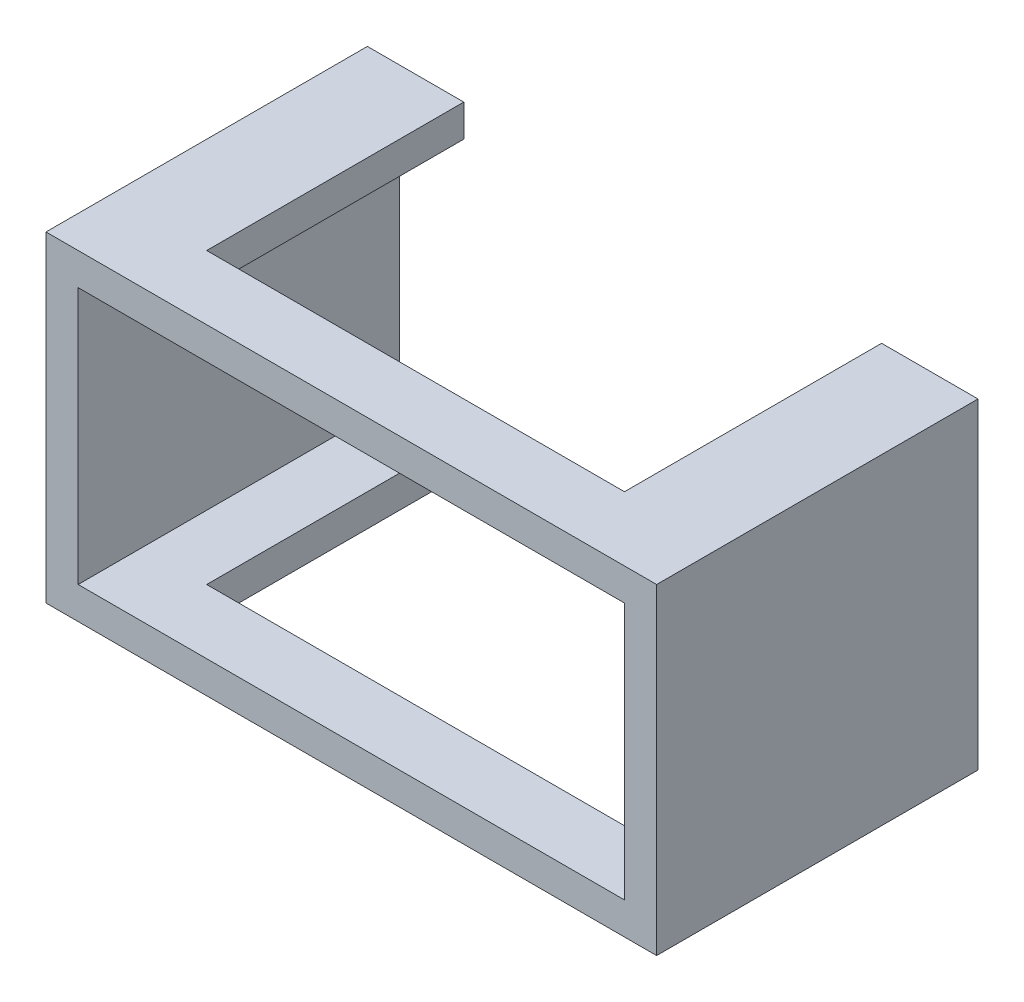
ISO-10303-21;
HEADER;
FILE_DESCRIPTION(('STEP AP214'),'2;1');
FILE_NAME('part.step','',(''),(''),'','','');
FILE_SCHEMA(('AUTOMOTIVE_DESIGN { 1 0 10303 214 1 1 1 1 }'));
ENDSEC;
DATA;
#1=APPLICATION_CONTEXT('core data for automotive mechanical design processes');
#2=APPLICATION_PROTOCOL_DEFINITION('international standard','automotive_design',2000,#1);
#3=PRODUCT_CONTEXT('',#1,'mechanical');
#4=PRODUCT('Part','Part','',(#3));
#5=PRODUCT_RELATED_PRODUCT_CATEGORY('part','',(#4));
#6=PRODUCT_DEFINITION_FORMATION('','',#4);
#7=PRODUCT_DEFINITION_CONTEXT('part definition',#1,'design');
#8=PRODUCT_DEFINITION('design','',#6,#7);
#9=PRODUCT_DEFINITION_SHAPE('','',#8);
#10=(LENGTH_UNIT() NAMED_UNIT(*) SI_UNIT(.MILLI.,.METRE.));
#11=(NAMED_UNIT(*) PLANE_ANGLE_UNIT() SI_UNIT($,.RADIAN.));
#12=(NAMED_UNIT(*) SI_UNIT($,.STERADIAN.) SOLID_ANGLE_UNIT());
#13=UNCERTAINTY_MEASURE_WITH_UNIT(LENGTH_MEASURE(1.E-05),#10,'distance_accuracy_value','');
#14=(GEOMETRIC_REPRESENTATION_CONTEXT(3) GLOBAL_UNCERTAINTY_ASSIGNED_CONTEXT((#13)) GLOBAL_UNIT_ASSIGNED_CONTEXT((#10,
#11,#12)) REPRESENTATION_CONTEXT('',''));
#15=CARTESIAN_POINT('',(0.,0.,0.));
#16=DIRECTION('',(0.,0.,1.));
#17=DIRECTION('',(1.,0.,0.));
#18=AXIS2_PLACEMENT_3D('',#15,#16,#17);
#19=CARTESIAN_POINT('',(-9.63013698630135,-2.77739726027397,10.));
#20=DIRECTION('',(0.,1.,0.));
#21=DIRECTION('',(0.,0.,1.));
#22=AXIS2_PLACEMENT_3D('',#19,#20,#21);
#23=PLANE('',#22);
#24=DIRECTION('',(0.,0.,-1.));
#25=VECTOR('',#24,1.);
#26=CARTESIAN_POINT('',(-6.63013698630135,-2.77739726027397,10.));
#27=LINE('',#26,#25);
#28=CARTESIAN_POINT('',(-6.63013698630135,-2.77739726027397,8.));
#29=VERTEX_POINT('',#28);
#30=CARTESIAN_POINT('',(-6.63013698630135,-2.77739726027397,0.));
#31=VERTEX_POINT('',#30);
#32=EDGE_CURVE('E166',#29,#31,#27,.T.);
#33=ORIENTED_EDGE('',*,*,#32,.F.);
#34=DIRECTION('',(1.,0.,0.));
#35=VECTOR('',#34,1.);
#36=CARTESIAN_POINT('',(-9.63013698630135,-2.77739726027397,8.));
#37=LINE('',#36,#35);
#38=CARTESIAN_POINT('',(6.36986301369865,-2.77739726027397,8.));
#39=VERTEX_POINT('',#38);
#40=EDGE_CURVE('E236',#29,#39,#37,.T.);
#41=ORIENTED_EDGE('',*,*,#40,.T.);
#42=DIRECTION('',(0.,0.,-1.));
#43=VECTOR('',#42,1.);
#44=CARTESIAN_POINT('',(6.36986301369865,-2.77739726027397,10.));
#45=LINE('',#44,#43);
#46=CARTESIAN_POINT('',(6.36986301369865,-2.77739726027397,0.));
#47=VERTEX_POINT('',#46);
#48=EDGE_CURVE('E244',#39,#47,#45,.T.);
#49=ORIENTED_EDGE('',*,*,#48,.T.);
#50=DIRECTION('',(1.,0.,0.));
#51=VECTOR('',#50,1.);
#52=CARTESIAN_POINT('',(-9.63013698630135,-2.77739726027397,0.));
#53=LINE('',#52,#51);
#54=CARTESIAN_POINT('',(9.36986301369865,-2.77739726027397,0.));
#55=VERTEX_POINT('',#54);
#56=EDGE_CURVE('E227',#47,#55,#53,.T.);
#57=ORIENTED_EDGE('',*,*,#56,.T.);
#58=DIRECTION('',(0.,0.,-1.));
#59=VECTOR('',#58,1.);
#60=CARTESIAN_POINT('',(9.36986301369865,-2.77739726027397,10.));
#61=LINE('',#60,#59);
#62=CARTESIAN_POINT('',(9.36986301369865,-2.77739726027397,10.));
#63=VERTEX_POINT('',#62);
#64=EDGE_CURVE('E188',#63,#55,#61,.T.);
#65=ORIENTED_EDGE('',*,*,#64,.F.);
#66=DIRECTION('',(1.,0.,0.));
#67=VECTOR('',#66,1.);
#68=CARTESIAN_POINT('',(-9.63013698630135,-2.77739726027397,10.));
#69=LINE('',#68,#67);
#70=CARTESIAN_POINT('',(-9.63013698630135,-2.77739726027397,10.));
#71=VERTEX_POINT('',#70);
#72=EDGE_CURVE('E270',#71,#63,#69,.T.);
#73=ORIENTED_EDGE('',*,*,#72,.F.);
#74=DIRECTION('',(0.,0.,-1.));
#75=VECTOR('',#74,1.);
#76=CARTESIAN_POINT('',(-9.63013698630135,-2.77739726027397,10.));
#77=LINE('',#76,#75);
#78=CARTESIAN_POINT('',(-9.63013698630135,-2.77739726027397,0.));
#79=VERTEX_POINT('',#78);
#80=EDGE_CURVE('E191',#71,#79,#77,.T.);
#81=ORIENTED_EDGE('',*,*,#80,.T.);
#82=EDGE_CURVE('E178',#79,#31,#53,.T.);
#83=ORIENTED_EDGE('',*,*,#82,.T.);
#84=EDGE_LOOP('',(#33,#41,#49,#57,#65,#73,#81,#83));
#85=FACE_BOUND('',#84,.T.);
#86=ADVANCED_FACE('F33',(#85),#23,.F.);
#87=CARTESIAN_POINT('',(-9.63013698630135,7.22260273972603,10.));
#88=DIRECTION('',(0.,-1.,0.));
#89=DIRECTION('',(0.,0.,-1.));
#90=AXIS2_PLACEMENT_3D('',#87,#88,#89);
#91=PLANE('',#90);
#92=DIRECTION('',(0.,0.,1.));
#93=VECTOR('',#92,1.);
#94=CARTESIAN_POINT('',(-6.63013698630135,7.22260273972603,10.));
#95=LINE('',#94,#93);
#96=CARTESIAN_POINT('',(-6.63013698630135,7.22260273972603,0.));
#97=VERTEX_POINT('',#96);
#98=CARTESIAN_POINT('',(-6.63013698630135,7.22260273972603,8.));
#99=VERTEX_POINT('',#98);
#100=EDGE_CURVE('E148',#97,#99,#95,.T.);
#101=ORIENTED_EDGE('',*,*,#100,.F.);
#102=DIRECTION('',(-1.,0.,0.));
#103=VECTOR('',#102,1.);
#104=CARTESIAN_POINT('',(-9.63013698630135,7.22260273972603,0.));
#105=LINE('',#104,#103);
#106=CARTESIAN_POINT('',(-9.63013698630135,7.22260273972603,0.));
#107=VERTEX_POINT('',#106);
#108=EDGE_CURVE('E162',#97,#107,#105,.T.);
#109=ORIENTED_EDGE('',*,*,#108,.T.);
#110=DIRECTION('',(0.,0.,-1.));
#111=VECTOR('',#110,1.);
#112=CARTESIAN_POINT('',(-9.63013698630135,7.22260273972603,10.));
#113=LINE('',#112,#111);
#114=CARTESIAN_POINT('',(-9.63013698630135,7.22260273972603,10.));
#115=VERTEX_POINT('',#114);
#116=EDGE_CURVE('E182',#115,#107,#113,.T.);
#117=ORIENTED_EDGE('',*,*,#116,.F.);
#118=DIRECTION('',(-1.,0.,0.));
#119=VECTOR('',#118,1.);
#120=CARTESIAN_POINT('',(-9.63013698630135,7.22260273972603,10.));
#121=LINE('',#120,#119);
#122=CARTESIAN_POINT('',(9.36986301369865,7.22260273972603,10.));
#123=VERTEX_POINT('',#122);
#124=EDGE_CURVE('E185',#123,#115,#121,.T.);
#125=ORIENTED_EDGE('',*,*,#124,.F.);
#126=DIRECTION('',(0.,0.,-1.));
#127=VECTOR('',#126,1.);
#128=CARTESIAN_POINT('',(9.36986301369865,7.22260273972603,10.));
#129=LINE('',#128,#127);
#130=CARTESIAN_POINT('',(9.36986301369865,7.22260273972603,0.));
#131=VERTEX_POINT('',#130);
#132=EDGE_CURVE('E184',#123,#131,#129,.T.);
#133=ORIENTED_EDGE('',*,*,#132,.T.);
#134=CARTESIAN_POINT('',(6.36986301369865,7.22260273972603,0.));
#135=VERTEX_POINT('',#134);
#136=EDGE_CURVE('E173',#131,#135,#105,.T.);
#137=ORIENTED_EDGE('',*,*,#136,.T.);
#138=DIRECTION('',(0.,0.,1.));
#139=VECTOR('',#138,1.);
#140=CARTESIAN_POINT('',(6.36986301369865,7.22260273972603,10.));
#141=LINE('',#140,#139);
#142=CARTESIAN_POINT('',(6.36986301369865,7.22260273972603,8.));
#143=VERTEX_POINT('',#142);
#144=EDGE_CURVE('E242',#135,#143,#141,.T.);
#145=ORIENTED_EDGE('',*,*,#144,.T.);
#146=DIRECTION('',(-1.,0.,0.));
#147=VECTOR('',#146,1.);
#148=CARTESIAN_POINT('',(-9.63013698630135,7.22260273972603,8.));
#149=LINE('',#148,#147);
#150=EDGE_CURVE('E165',#143,#99,#149,.T.);
#151=ORIENTED_EDGE('',*,*,#150,.T.);
#152=EDGE_LOOP('',(#101,#109,#117,#125,#133,#137,#145,#151));
#153=FACE_BOUND('',#152,.T.);
#154=ADVANCED_FACE('F160',(#153),#91,.F.);
#155=CARTESIAN_POINT('',(0.,0.,0.));
#156=DIRECTION('',(0.,0.,1.));
#157=DIRECTION('',(1.,0.,0.));
#158=AXIS2_PLACEMENT_3D('',#155,#156,#157);
#159=PLANE('',#158);
#160=DIRECTION('',(0.,-1.,0.));
#161=VECTOR('',#160,1.);
#162=CARTESIAN_POINT('',(-6.63013698630135,7.60514930969981,0.));
#163=LINE('',#162,#161);
#164=CARTESIAN_POINT('',(-6.63013698630135,-1.77739726027397,0.));
#165=VERTEX_POINT('',#164);
#166=EDGE_CURVE('E156',#165,#31,#163,.T.);
#167=ORIENTED_EDGE('',*,*,#166,.T.);
#168=ORIENTED_EDGE('',*,*,#82,.F.);
#169=DIRECTION('',(0.,-1.,0.));
#170=VECTOR('',#169,1.);
#171=CARTESIAN_POINT('',(-9.63013698630135,7.22260273972603,0.));
#172=LINE('',#171,#170);
#173=EDGE_CURVE('E172',#107,#79,#172,.T.);
#174=ORIENTED_EDGE('',*,*,#173,.F.);
#175=ORIENTED_EDGE('',*,*,#108,.F.);
#176=CARTESIAN_POINT('',(-6.63013698630135,6.22260273972603,0.));
#177=VERTEX_POINT('',#176);
#178=EDGE_CURVE('E144',#97,#177,#163,.T.);
#179=ORIENTED_EDGE('',*,*,#178,.T.);
#180=DIRECTION('',(-1.,0.,0.));
#181=VECTOR('',#180,1.);
#182=CARTESIAN_POINT('',(0.,6.22260273972603,0.));
#183=LINE('',#182,#181);
#184=CARTESIAN_POINT('',(-8.63013698630136,6.22260273972603,0.));
#185=VERTEX_POINT('',#184);
#186=EDGE_CURVE('E201',#177,#185,#183,.T.);
#187=ORIENTED_EDGE('',*,*,#186,.T.);
#188=DIRECTION('',(0.,-1.,0.));
#189=VECTOR('',#188,1.);
#190=CARTESIAN_POINT('',(-8.63013698630135,0.,0.));
#191=LINE('',#190,#189);
#192=CARTESIAN_POINT('',(-8.63013698630135,-1.77739726027397,0.));
#193=VERTEX_POINT('',#192);
#194=EDGE_CURVE('E205',#185,#193,#191,.T.);
#195=ORIENTED_EDGE('',*,*,#194,.T.);
#196=DIRECTION('',(1.,0.,0.));
#197=VECTOR('',#196,1.);
#198=CARTESIAN_POINT('',(0.,-1.77739726027397,0.));
#199=LINE('',#198,#197);
#200=EDGE_CURVE('E195',#193,#165,#199,.T.);
#201=ORIENTED_EDGE('',*,*,#200,.T.);
#202=EDGE_LOOP('',(#167,#168,#174,#175,#179,#187,#195,#201));
#203=FACE_BOUND('',#202,.T.);
#204=ADVANCED_FACE('F170',(#203),#159,.F.);
#205=CARTESIAN_POINT('',(-8.63013698630136,6.22260273972603,-2.));
#206=DIRECTION('',(0.,1.,0.));
#207=DIRECTION('',(0.,0.,1.));
#208=AXIS2_PLACEMENT_3D('',#205,#206,#207);
#209=PLANE('',#208);
#210=DIRECTION('',(0.,0.,-1.));
#211=VECTOR('',#210,1.);
#212=CARTESIAN_POINT('',(-6.63013698630135,6.22260273972603,-2.));
#213=LINE('',#212,#211);
#214=CARTESIAN_POINT('',(-6.63013698630135,6.22260273972603,8.));
#215=VERTEX_POINT('',#214);
#216=EDGE_CURVE('E151',#215,#177,#213,.T.);
#217=ORIENTED_EDGE('',*,*,#216,.F.);
#218=DIRECTION('',(1.,0.,0.));
#219=VECTOR('',#218,1.);
#220=CARTESIAN_POINT('',(-8.63013698630136,6.22260273972603,8.));
#221=LINE('',#220,#219);
#222=CARTESIAN_POINT('',(6.36986301369865,6.22260273972603,8.));
#223=VERTEX_POINT('',#222);
#224=EDGE_CURVE('E232',#215,#223,#221,.T.);
#225=ORIENTED_EDGE('',*,*,#224,.T.);
#226=DIRECTION('',(0.,0.,-1.));
#227=VECTOR('',#226,1.);
#228=CARTESIAN_POINT('',(6.36986301369865,6.22260273972603,-2.));
#229=LINE('',#228,#227);
#230=CARTESIAN_POINT('',(6.36986301369865,6.22260273972603,0.));
#231=VERTEX_POINT('',#230);
#232=EDGE_CURVE('E239',#223,#231,#229,.T.);
#233=ORIENTED_EDGE('',*,*,#232,.T.);
#234=CARTESIAN_POINT('',(8.36986301369865,6.22260273972603,0.));
#235=VERTEX_POINT('',#234);
#236=EDGE_CURVE('E202',#235,#231,#183,.T.);
#237=ORIENTED_EDGE('',*,*,#236,.F.);
#238=DIRECTION('',(0.,0.,1.));
#239=VECTOR('',#238,1.);
#240=CARTESIAN_POINT('',(8.36986301369865,6.22260273972603,-2.));
#241=LINE('',#240,#239);
#242=CARTESIAN_POINT('',(8.36986301369865,6.22260273972603,10.));
#243=VERTEX_POINT('',#242);
#244=EDGE_CURVE('E262',#235,#243,#241,.T.);
#245=ORIENTED_EDGE('',*,*,#244,.T.);
#246=DIRECTION('',(-1.,0.,0.));
#247=VECTOR('',#246,1.);
#248=CARTESIAN_POINT('',(-8.63013698630136,6.22260273972603,10.));
#249=LINE('',#248,#247);
#250=CARTESIAN_POINT('',(-8.63013698630136,6.22260273972603,10.));
#251=VERTEX_POINT('',#250);
#252=EDGE_CURVE('E256',#243,#251,#249,.T.);
#253=ORIENTED_EDGE('',*,*,#252,.T.);
#254=DIRECTION('',(0.,0.,1.));
#255=VECTOR('',#254,1.);
#256=CARTESIAN_POINT('',(-8.63013698630136,6.22260273972603,-2.));
#257=LINE('',#256,#255);
#258=EDGE_CURVE('E260',#185,#251,#257,.T.);
#259=ORIENTED_EDGE('',*,*,#258,.F.);
#260=ORIENTED_EDGE('',*,*,#186,.F.);
#261=EDGE_LOOP('',(#217,#225,#233,#237,#245,#253,#259,#260));
#262=FACE_BOUND('',#261,.T.);
#263=ADVANCED_FACE('F297',(#262),#209,.F.);
#264=CARTESIAN_POINT('',(-8.63013698630135,-1.77739726027397,-2.));
#265=DIRECTION('',(0.,-1.,0.));
#266=DIRECTION('',(1.,0.,0.));
#267=AXIS2_PLACEMENT_3D('',#264,#265,#266);
#268=PLANE('',#267);
#269=DIRECTION('',(0.,0.,1.));
#270=VECTOR('',#269,1.);
#271=CARTESIAN_POINT('',(-6.63013698630135,-1.77739726027397,-2.));
#272=LINE('',#271,#270);
#273=CARTESIAN_POINT('',(-6.63013698630135,-1.77739726027397,8.));
#274=VERTEX_POINT('',#273);
#275=EDGE_CURVE('E11',#165,#274,#272,.T.);
#276=ORIENTED_EDGE('',*,*,#275,.F.);
#277=ORIENTED_EDGE('',*,*,#200,.F.);
#278=DIRECTION('',(0.,0.,1.));
#279=VECTOR('',#278,1.);
#280=CARTESIAN_POINT('',(-8.63013698630135,-1.77739726027397,-2.));
#281=LINE('',#280,#279);
#282=CARTESIAN_POINT('',(-8.63013698630135,-1.77739726027397,10.));
#283=VERTEX_POINT('',#282);
#284=EDGE_CURVE('E259',#193,#283,#281,.T.);
#285=ORIENTED_EDGE('',*,*,#284,.T.);
#286=DIRECTION('',(1.,0.,0.));
#287=VECTOR('',#286,1.);
#288=CARTESIAN_POINT('',(-8.63013698630135,-1.77739726027397,10.));
#289=LINE('',#288,#287);
#290=CARTESIAN_POINT('',(8.36986301369865,-1.77739726027397,10.));
#291=VERTEX_POINT('',#290);
#292=EDGE_CURVE('E250',#283,#291,#289,.T.);
#293=ORIENTED_EDGE('',*,*,#292,.T.);
#294=DIRECTION('',(0.,0.,1.));
#295=VECTOR('',#294,1.);
#296=CARTESIAN_POINT('',(8.36986301369865,-1.77739726027397,-2.));
#297=LINE('',#296,#295);
#298=CARTESIAN_POINT('',(8.36986301369865,-1.77739726027397,0.));
#299=VERTEX_POINT('',#298);
#300=EDGE_CURVE('E264',#299,#291,#297,.T.);
#301=ORIENTED_EDGE('',*,*,#300,.F.);
#302=CARTESIAN_POINT('',(6.36986301369865,-1.77739726027397,0.));
#303=VERTEX_POINT('',#302);
#304=EDGE_CURVE('E194',#303,#299,#199,.T.);
#305=ORIENTED_EDGE('',*,*,#304,.F.);
#306=DIRECTION('',(0.,0.,1.));
#307=VECTOR('',#306,1.);
#308=CARTESIAN_POINT('',(6.36986301369865,-1.77739726027397,-2.));
#309=LINE('',#308,#307);
#310=CARTESIAN_POINT('',(6.36986301369865,-1.77739726027397,8.));
#311=VERTEX_POINT('',#310);
#312=EDGE_CURVE('E41',#303,#311,#309,.T.);
#313=ORIENTED_EDGE('',*,*,#312,.T.);
#314=DIRECTION('',(-1.,0.,0.));
#315=VECTOR('',#314,1.);
#316=CARTESIAN_POINT('',(-8.63013698630135,-1.77739726027397,8.));
#317=LINE('',#316,#315);
#318=EDGE_CURVE('E208',#311,#274,#317,.T.);
#319=ORIENTED_EDGE('',*,*,#318,.T.);
#320=EDGE_LOOP('',(#276,#277,#285,#293,#301,#305,#313,#319));
#321=FACE_BOUND('',#320,.T.);
#322=ADVANCED_FACE('F214',(#321),#268,.F.);
#323=CARTESIAN_POINT('',(-9.63013698630135,7.22260273972603,10.));
#324=DIRECTION('',(1.,0.,0.));
#325=DIRECTION('',(0.,1.,0.));
#326=AXIS2_PLACEMENT_3D('',#323,#324,#325);
#327=PLANE('',#326);
#328=ORIENTED_EDGE('',*,*,#173,.T.);
#329=ORIENTED_EDGE('',*,*,#80,.F.);
#330=DIRECTION('',(0.,-1.,0.));
#331=VECTOR('',#330,1.);
#332=CARTESIAN_POINT('',(-9.63013698630135,7.22260273972603,10.));
#333=LINE('',#332,#331);
#334=EDGE_CURVE('E177',#115,#71,#333,.T.);
#335=ORIENTED_EDGE('',*,*,#334,.F.);
#336=ORIENTED_EDGE('',*,*,#116,.T.);
#337=EDGE_LOOP('',(#328,#329,#335,#336));
#338=FACE_BOUND('',#337,.T.);
#339=ADVANCED_FACE('F35',(#338),#327,.F.);
#340=CARTESIAN_POINT('',(9.36986301369865,7.22260273972603,10.));
#341=DIRECTION('',(-1.,0.,0.));
#342=DIRECTION('',(0.,-1.,0.));
#343=AXIS2_PLACEMENT_3D('',#340,#341,#342);
#344=PLANE('',#343);
#345=DIRECTION('',(0.,1.,0.));
#346=VECTOR('',#345,1.);
#347=CARTESIAN_POINT('',(9.36986301369865,7.22260273972603,0.));
#348=LINE('',#347,#346);
#349=EDGE_CURVE('E174',#55,#131,#348,.T.);
#350=ORIENTED_EDGE('',*,*,#349,.T.);
#351=ORIENTED_EDGE('',*,*,#132,.F.);
#352=DIRECTION('',(0.,1.,0.));
#353=VECTOR('',#352,1.);
#354=CARTESIAN_POINT('',(9.36986301369865,7.22260273972603,10.));
#355=LINE('',#354,#353);
#356=EDGE_CURVE('E272',#63,#123,#355,.T.);
#357=ORIENTED_EDGE('',*,*,#356,.F.);
#358=ORIENTED_EDGE('',*,*,#64,.T.);
#359=EDGE_LOOP('',(#350,#351,#357,#358));
#360=FACE_BOUND('',#359,.T.);
#361=ADVANCED_FACE('F281',(#360),#344,.F.);
#362=CARTESIAN_POINT('',(0.,0.,10.));
#363=DIRECTION('',(0.,0.,1.));
#364=DIRECTION('',(1.,0.,0.));
#365=AXIS2_PLACEMENT_3D('',#362,#363,#364);
#366=PLANE('',#365);
#367=DIRECTION('',(0.,-1.,0.));
#368=VECTOR('',#367,1.);
#369=CARTESIAN_POINT('',(-8.63013698630136,6.22260273972603,10.));
#370=LINE('',#369,#368);
#371=EDGE_CURVE('E248',#251,#283,#370,.T.);
#372=ORIENTED_EDGE('',*,*,#371,.F.);
#373=ORIENTED_EDGE('',*,*,#252,.F.);
#374=DIRECTION('',(0.,1.,0.));
#375=VECTOR('',#374,1.);
#376=CARTESIAN_POINT('',(8.36986301369865,6.22260273972603,10.));
#377=LINE('',#376,#375);
#378=EDGE_CURVE('E253',#291,#243,#377,.T.);
#379=ORIENTED_EDGE('',*,*,#378,.F.);
#380=ORIENTED_EDGE('',*,*,#292,.F.);
#381=EDGE_LOOP('',(#372,#373,#379,#380));
#382=FACE_BOUND('',#381,.T.);
#383=ORIENTED_EDGE('',*,*,#334,.T.);
#384=ORIENTED_EDGE('',*,*,#72,.T.);
#385=ORIENTED_EDGE('',*,*,#356,.T.);
#386=ORIENTED_EDGE('',*,*,#124,.T.);
#387=EDGE_LOOP('',(#383,#384,#385,#386));
#388=FACE_BOUND('',#387,.T.);
#389=ADVANCED_FACE('F288',(#382,#388),#366,.T.);
#390=ORIENTED_EDGE('',*,*,#56,.F.);
#391=DIRECTION('',(0.,-1.,0.));
#392=VECTOR('',#391,1.);
#393=CARTESIAN_POINT('',(6.36986301369865,7.60514930969981,0.));
#394=LINE('',#393,#392);
#395=EDGE_CURVE('E155',#303,#47,#394,.T.);
#396=ORIENTED_EDGE('',*,*,#395,.F.);
#397=ORIENTED_EDGE('',*,*,#304,.T.);
#398=DIRECTION('',(0.,1.,0.));
#399=VECTOR('',#398,1.);
#400=CARTESIAN_POINT('',(8.36986301369865,0.,0.));
#401=LINE('',#400,#399);
#402=EDGE_CURVE('E198',#299,#235,#401,.T.);
#403=ORIENTED_EDGE('',*,*,#402,.T.);
#404=ORIENTED_EDGE('',*,*,#236,.T.);
#405=EDGE_CURVE('E228',#135,#231,#394,.T.);
#406=ORIENTED_EDGE('',*,*,#405,.F.);
#407=ORIENTED_EDGE('',*,*,#136,.F.);
#408=ORIENTED_EDGE('',*,*,#349,.F.);
#409=EDGE_LOOP('',(#390,#396,#397,#403,#404,#406,#407,#408));
#410=FACE_BOUND('',#409,.T.);
#411=ADVANCED_FACE('F225',(#410),#159,.F.);
#412=CARTESIAN_POINT('',(-8.63013698630136,6.22260273972603,-2.));
#413=DIRECTION('',(-1.,0.,0.));
#414=DIRECTION('',(0.,-1.,0.));
#415=AXIS2_PLACEMENT_3D('',#412,#413,#414);
#416=PLANE('',#415);
#417=ORIENTED_EDGE('',*,*,#258,.T.);
#418=ORIENTED_EDGE('',*,*,#371,.T.);
#419=ORIENTED_EDGE('',*,*,#284,.F.);
#420=ORIENTED_EDGE('',*,*,#194,.F.);
#421=EDGE_LOOP('',(#417,#418,#419,#420));
#422=FACE_BOUND('',#421,.T.);
#423=ADVANCED_FACE('F307',(#422),#416,.F.);
#424=CARTESIAN_POINT('',(8.36986301369865,6.22260273972603,-2.));
#425=DIRECTION('',(1.,0.,0.));
#426=DIRECTION('',(0.,0.,-1.));
#427=AXIS2_PLACEMENT_3D('',#424,#425,#426);
#428=PLANE('',#427);
#429=ORIENTED_EDGE('',*,*,#300,.T.);
#430=ORIENTED_EDGE('',*,*,#378,.T.);
#431=ORIENTED_EDGE('',*,*,#244,.F.);
#432=ORIENTED_EDGE('',*,*,#402,.F.);
#433=EDGE_LOOP('',(#429,#430,#431,#432));
#434=FACE_BOUND('',#433,.T.);
#435=ADVANCED_FACE('F312',(#434),#428,.F.);
#436=CARTESIAN_POINT('',(0.,0.,8.));
#437=DIRECTION('',(0.,0.,1.));
#438=DIRECTION('',(1.,0.,0.));
#439=AXIS2_PLACEMENT_3D('',#436,#437,#438);
#440=PLANE('',#439);
#441=DIRECTION('',(0.,-1.,0.));
#442=VECTOR('',#441,1.);
#443=CARTESIAN_POINT('',(-6.63013698630135,7.60514930969981,8.));
#444=LINE('',#443,#442);
#445=EDGE_CURVE('E56',#274,#29,#444,.T.);
#446=ORIENTED_EDGE('',*,*,#445,.F.);
#447=ORIENTED_EDGE('',*,*,#318,.F.);
#448=DIRECTION('',(0.,-1.,0.));
#449=VECTOR('',#448,1.);
#450=CARTESIAN_POINT('',(6.36986301369865,7.60514930969981,8.));
#451=LINE('',#450,#449);
#452=EDGE_CURVE('E222',#311,#39,#451,.T.);
#453=ORIENTED_EDGE('',*,*,#452,.T.);
#454=ORIENTED_EDGE('',*,*,#40,.F.);
#455=EDGE_LOOP('',(#446,#447,#453,#454));
#456=FACE_BOUND('',#455,.T.);
#457=ADVANCED_FACE('F317',(#456),#440,.F.);
#458=CARTESIAN_POINT('',(6.36986301369865,7.60514930969981,8.));
#459=DIRECTION('',(1.,0.,0.));
#460=DIRECTION('',(0.,1.,0.));
#461=AXIS2_PLACEMENT_3D('',#458,#459,#460);
#462=PLANE('',#461);
#463=ORIENTED_EDGE('',*,*,#452,.F.);
#464=ORIENTED_EDGE('',*,*,#312,.F.);
#465=ORIENTED_EDGE('',*,*,#395,.T.);
#466=ORIENTED_EDGE('',*,*,#48,.F.);
#467=EDGE_LOOP('',(#463,#464,#465,#466));
#468=FACE_BOUND('',#467,.T.);
#469=ADVANCED_FACE('F219',(#468),#462,.F.);
#470=CARTESIAN_POINT('',(-6.63013698630135,7.60514930969981,8.));
#471=DIRECTION('',(1.,0.,0.));
#472=DIRECTION('',(0.,1.,0.));
#473=AXIS2_PLACEMENT_3D('',#470,#471,#472);
#474=PLANE('',#473);
#475=ORIENTED_EDGE('',*,*,#32,.T.);
#476=ORIENTED_EDGE('',*,*,#166,.F.);
#477=ORIENTED_EDGE('',*,*,#275,.T.);
#478=ORIENTED_EDGE('',*,*,#445,.T.);
#479=EDGE_LOOP('',(#475,#476,#477,#478));
#480=FACE_BOUND('',#479,.T.);
#481=ADVANCED_FACE('F322',(#480),#474,.T.);
#482=ORIENTED_EDGE('',*,*,#100,.T.);
#483=EDGE_CURVE('E350',#99,#215,#444,.T.);
#484=ORIENTED_EDGE('',*,*,#483,.T.);
#485=ORIENTED_EDGE('',*,*,#216,.T.);
#486=ORIENTED_EDGE('',*,*,#178,.F.);
#487=EDGE_LOOP('',(#482,#484,#485,#486));
#488=FACE_BOUND('',#487,.T.);
#489=ADVANCED_FACE('F146',(#488),#474,.T.);
#490=ORIENTED_EDGE('',*,*,#405,.T.);
#491=ORIENTED_EDGE('',*,*,#232,.F.);
#492=EDGE_CURVE('E48',#143,#223,#451,.T.);
#493=ORIENTED_EDGE('',*,*,#492,.F.);
#494=ORIENTED_EDGE('',*,*,#144,.F.);
#495=EDGE_LOOP('',(#490,#491,#493,#494));
#496=FACE_BOUND('',#495,.T.);
#497=ADVANCED_FACE('F328',(#496),#462,.F.);
#498=ORIENTED_EDGE('',*,*,#492,.T.);
#499=ORIENTED_EDGE('',*,*,#224,.F.);
#500=ORIENTED_EDGE('',*,*,#483,.F.);
#501=ORIENTED_EDGE('',*,*,#150,.F.);
#502=EDGE_LOOP('',(#498,#499,#500,#501));
#503=FACE_BOUND('',#502,.T.);
#504=ADVANCED_FACE('F330',(#503),#440,.F.);
#505=CLOSED_SHELL('',(#86,#154,#204,#263,#322,#339,#361,#389,#411,#423,#435,#457,#469,#481,#489,
#497,#504));
#506=MANIFOLD_SOLID_BREP('B2',#505);
#507=ADVANCED_BREP_SHAPE_REPRESENTATION('',(#18,#506),#14);
#508=SHAPE_DEFINITION_REPRESENTATION(#9,#507);
ENDSEC;
END-ISO-10303-21;
